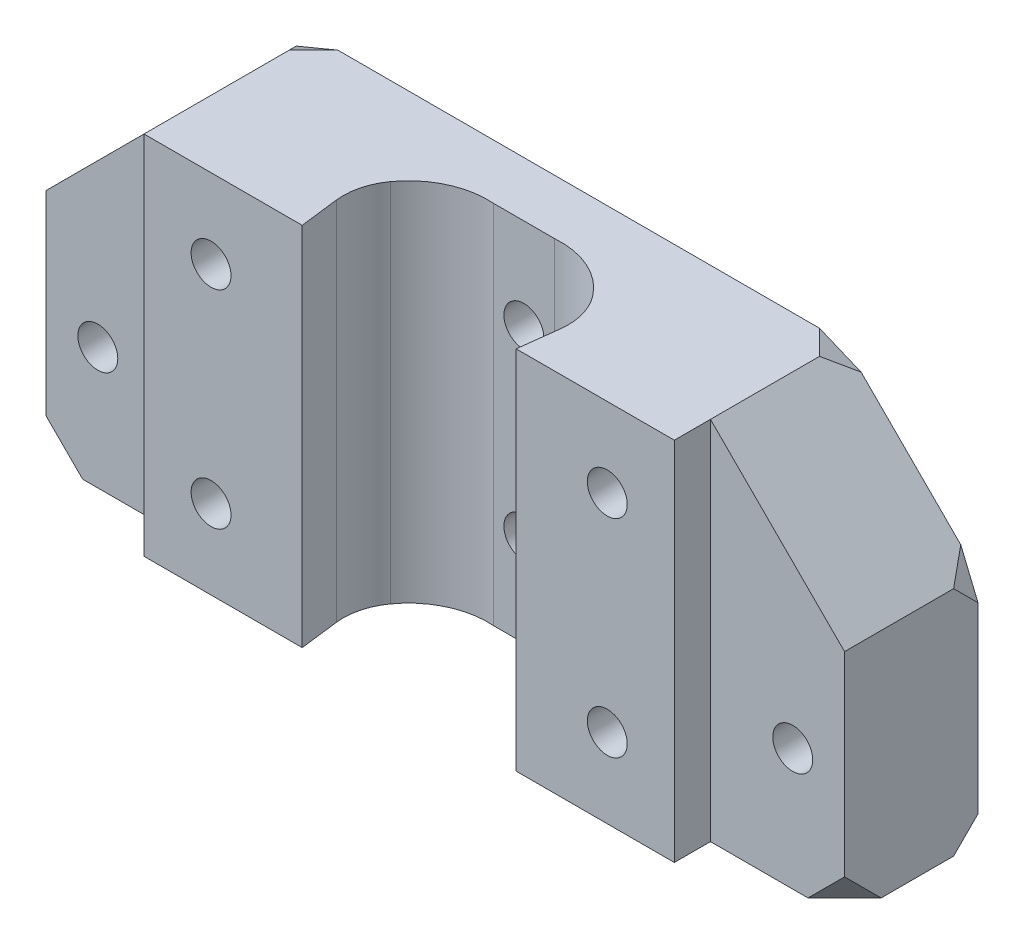
ISO-10303-21;
HEADER;
FILE_DESCRIPTION(('STEP AP214'),'2;1');
FILE_NAME('part.step','',(''),(''),'','','');
FILE_SCHEMA(('AUTOMOTIVE_DESIGN { 1 0 10303 214 1 1 1 1 }'));
ENDSEC;
DATA;
#1=APPLICATION_CONTEXT('core data for automotive mechanical design processes');
#2=APPLICATION_PROTOCOL_DEFINITION('international standard','automotive_design',2000,#1);
#3=PRODUCT_CONTEXT('',#1,'mechanical');
#4=PRODUCT('Part','Part','',(#3));
#5=PRODUCT_RELATED_PRODUCT_CATEGORY('part','',(#4));
#6=PRODUCT_DEFINITION_FORMATION('','',#4);
#7=PRODUCT_DEFINITION_CONTEXT('part definition',#1,'design');
#8=PRODUCT_DEFINITION('design','',#6,#7);
#9=PRODUCT_DEFINITION_SHAPE('','',#8);
#10=(LENGTH_UNIT() NAMED_UNIT(*) SI_UNIT(.MILLI.,.METRE.));
#11=(NAMED_UNIT(*) PLANE_ANGLE_UNIT() SI_UNIT($,.RADIAN.));
#12=(NAMED_UNIT(*) SI_UNIT($,.STERADIAN.) SOLID_ANGLE_UNIT());
#13=UNCERTAINTY_MEASURE_WITH_UNIT(LENGTH_MEASURE(1.E-05),#10,'distance_accuracy_value','');
#14=(GEOMETRIC_REPRESENTATION_CONTEXT(3) GLOBAL_UNCERTAINTY_ASSIGNED_CONTEXT((#13)) GLOBAL_UNIT_ASSIGNED_CONTEXT((#10,
#11,#12)) REPRESENTATION_CONTEXT('',''));
#15=CARTESIAN_POINT('',(0.,0.,0.));
#16=DIRECTION('',(0.,0.,1.));
#17=DIRECTION('',(1.,0.,0.));
#18=AXIS2_PLACEMENT_3D('',#15,#16,#17);
#19=CARTESIAN_POINT('',(12.657693959334,0.,2.96357615590343));
#20=DIRECTION('',(0.,-1.,0.));
#21=DIRECTION('',(0.,0.,-1.));
#22=AXIS2_PLACEMENT_3D('',#19,#20,#21);
#23=PLANE('',#22);
#24=DIRECTION('',(-1.,0.,0.));
#25=VECTOR('',#24,1.);
#26=CARTESIAN_POINT('',(62.1301615680965,0.,-19.));
#27=LINE('',#26,#25);
#28=CARTESIAN_POINT('',(80.1301615680965,0.,-19.));
#29=VERTEX_POINT('',#28);
#30=CARTESIAN_POINT('',(-42.8698384319035,0.,-19.));
#31=VERTEX_POINT('',#30);
#32=EDGE_CURVE('E216',#29,#31,#27,.T.);
#33=ORIENTED_EDGE('',*,*,#32,.F.);
#34=DIRECTION('',(0.707106781186548,0.,0.707106781186547));
#35=VECTOR('',#34,1.);
#36=CARTESIAN_POINT('',(57.3757158416669,0.,-41.7544457264295));
#37=LINE('',#36,#35);
#38=CARTESIAN_POINT('',(84.1301615680965,0.,-15.));
#39=VERTEX_POINT('',#38);
#40=EDGE_CURVE('E49',#29,#39,#37,.T.);
#41=ORIENTED_EDGE('',*,*,#40,.T.);
#42=DIRECTION('',(0.,0.,1.));
#43=VECTOR('',#42,1.);
#44=CARTESIAN_POINT('',(84.1301615680965,0.,-19.));
#45=LINE('',#44,#43);
#46=CARTESIAN_POINT('',(84.1301615680965,0.,-3.11185281572853));
#47=VERTEX_POINT('',#46);
#48=EDGE_CURVE('E204',#39,#47,#45,.T.);
#49=ORIENTED_EDGE('',*,*,#48,.T.);
#50=DIRECTION('',(-0.707106781186548,0.,0.707106781186547));
#51=VECTOR('',#50,1.);
#52=CARTESIAN_POINT('',(45.3562132778992,0.,35.6620954744687));
#53=LINE('',#52,#51);
#54=CARTESIAN_POINT('',(78.1301615680965,0.,2.88814718427147));
#55=VERTEX_POINT('',#54);
#56=EDGE_CURVE('E272',#47,#55,#53,.T.);
#57=ORIENTED_EDGE('',*,*,#56,.T.);
#58=DIRECTION('',(-1.,0.,0.));
#59=VECTOR('',#58,1.);
#60=CARTESIAN_POINT('',(84.1301615680965,0.,2.88814718427147));
#61=LINE('',#60,#59);
#62=CARTESIAN_POINT('',(62.1301615680965,0.,2.88814718427147));
#63=VERTEX_POINT('',#62);
#64=EDGE_CURVE('E211',#55,#63,#61,.T.);
#65=ORIENTED_EDGE('',*,*,#64,.T.);
#66=DIRECTION('',(0.,0.,1.));
#67=VECTOR('',#66,1.);
#68=CARTESIAN_POINT('',(62.1301615680965,0.,-76.9061812346819));
#69=LINE('',#68,#67);
#70=CARTESIAN_POINT('',(62.1301615680965,0.,8.81314718427147));
#71=VERTEX_POINT('',#70);
#72=EDGE_CURVE('E373',#63,#71,#69,.T.);
#73=ORIENTED_EDGE('',*,*,#72,.T.);
#74=DIRECTION('',(-1.,0.,0.));
#75=VECTOR('',#74,1.);
#76=CARTESIAN_POINT('',(-2.86983843190352,0.,8.81314718427147));
#77=LINE('',#76,#75);
#78=CARTESIAN_POINT('',(36.1782047289997,0.,8.81314718427147));
#79=VERTEX_POINT('',#78);
#80=EDGE_CURVE('E352',#71,#79,#77,.T.);
#81=ORIENTED_EDGE('',*,*,#80,.T.);
#82=DIRECTION('',(0.121869343405151,0.,-0.992546151641322));
#83=VECTOR('',#82,1.);
#84=CARTESIAN_POINT('',(33.961097926045,0.,26.8700330553533));
#85=LINE('',#84,#83);
#86=CARTESIAN_POINT('',(36.970576623517,2.22044604925031E-13,2.35979597553153));
#87=VERTEX_POINT('',#86);
#88=EDGE_CURVE('E300',#79,#87,#85,.T.);
#89=ORIENTED_EDGE('',*,*,#88,.T.);
#90=CARTESIAN_POINT('',(27.0451151071038,0.,1.14110254148002));
#91=DIRECTION('',(0.,-1.,0.));
#92=DIRECTION('',(0.,0.,-1.));
#93=AXIS2_PLACEMENT_3D('',#90,#91,#92);
#94=CIRCLE('',#93,10.);
#95=CARTESIAN_POINT('',(34.9994172411373,0.,-4.91934938560512));
#96=VERTEX_POINT('',#95);
#97=EDGE_CURVE('E302',#96,#87,#94,.T.);
#98=ORIENTED_EDGE('',*,*,#97,.F.);
#99=CARTESIAN_POINT('',(24.6588244668938,0.,2.95923811960556));
#100=DIRECTION('',(0.,-1.,0.));
#101=DIRECTION('',(0.,0.,-1.));
#102=AXIS2_PLACEMENT_3D('',#99,#100,#101);
#103=CIRCLE('',#102,13.);
#104=CARTESIAN_POINT('',(23.6301615680965,0.,-10.));
#105=VERTEX_POINT('',#104);
#106=EDGE_CURVE('E306',#105,#96,#103,.T.);
#107=ORIENTED_EDGE('',*,*,#106,.F.);
#108=DIRECTION('',(1.,0.,0.));
#109=VECTOR('',#108,1.);
#110=CARTESIAN_POINT('',(12.657693959334,0.,-10.));
#111=LINE('',#110,#109);
#112=CARTESIAN_POINT('',(13.6301615680965,0.,-10.));
#113=VERTEX_POINT('',#112);
#114=EDGE_CURVE('E303',#105,#113,#111,.F.);
#115=ORIENTED_EDGE('',*,*,#114,.T.);
#116=CARTESIAN_POINT('',(12.657693959334,0.,2.96357615590343));
#117=DIRECTION('',(0.,-1.,0.));
#118=DIRECTION('',(0.,0.,-1.));
#119=AXIS2_PLACEMENT_3D('',#116,#117,#118);
#120=CIRCLE('',#119,13.);
#121=CARTESIAN_POINT('',(2.1101832656479,0.,-4.63576711615484));
#122=VERTEX_POINT('',#121);
#123=EDGE_CURVE('E312',#122,#113,#120,.T.);
#124=ORIENTED_EDGE('',*,*,#123,.F.);
#125=CARTESIAN_POINT('',(10.2236530300218,0.,1.20988155465921));
#126=DIRECTION('',(0.,-1.,0.));
#127=DIRECTION('',(0.,0.,-1.));
#128=AXIS2_PLACEMENT_3D('',#125,#126,#127);
#129=CIRCLE('',#128,10.);
#130=CARTESIAN_POINT('',(0.298191513608604,0.,2.42857498871066));
#131=VERTEX_POINT('',#130);
#132=EDGE_CURVE('E310',#131,#122,#129,.T.);
#133=ORIENTED_EDGE('',*,*,#132,.F.);
#134=DIRECTION('',(0.121869343405145,0.,0.992546151641322));
#135=VECTOR('',#134,1.);
#136=CARTESIAN_POINT('',(0.298191513608603,0.,2.42857498871065));
#137=LINE('',#136,#135);
#138=CARTESIAN_POINT('',(1.08211840719341,0.,8.81314718427147));
#139=VERTEX_POINT('',#138);
#140=EDGE_CURVE('E297',#131,#139,#137,.T.);
#141=ORIENTED_EDGE('',*,*,#140,.T.);
#142=CARTESIAN_POINT('',(-24.8698384319035,0.,8.81314718427147));
#143=VERTEX_POINT('',#142);
#144=EDGE_CURVE('E355',#139,#143,#77,.T.);
#145=ORIENTED_EDGE('',*,*,#144,.T.);
#146=DIRECTION('',(0.,0.,1.));
#147=VECTOR('',#146,1.);
#148=CARTESIAN_POINT('',(-24.8698384319035,0.,-76.9061812346819));
#149=LINE('',#148,#147);
#150=CARTESIAN_POINT('',(-24.8698384319035,0.,2.88814718427147));
#151=VERTEX_POINT('',#150);
#152=EDGE_CURVE('E361',#151,#143,#149,.T.);
#153=ORIENTED_EDGE('',*,*,#152,.F.);
#154=DIRECTION('',(1.,0.,0.));
#155=VECTOR('',#154,1.);
#156=CARTESIAN_POINT('',(-46.8698384319035,0.,2.88814718427147));
#157=LINE('',#156,#155);
#158=CARTESIAN_POINT('',(-40.8698384319035,0.,2.88814718427147));
#159=VERTEX_POINT('',#158);
#160=EDGE_CURVE('E411',#159,#151,#157,.T.);
#161=ORIENTED_EDGE('',*,*,#160,.F.);
#162=DIRECTION('',(-0.707106781186547,0.,-0.707106781186548));
#163=VECTOR('',#162,1.);
#164=CARTESIAN_POINT('',(-14.0683577504688,0.,29.6896278657062));
#165=LINE('',#164,#163);
#166=CARTESIAN_POINT('',(-46.8698384319035,0.,-3.11185281572854));
#167=VERTEX_POINT('',#166);
#168=EDGE_CURVE('E265',#159,#167,#165,.T.);
#169=ORIENTED_EDGE('',*,*,#168,.T.);
#170=DIRECTION('',(0.,0.,1.));
#171=VECTOR('',#170,1.);
#172=CARTESIAN_POINT('',(-46.8698384319035,0.,-19.));
#173=LINE('',#172,#171);
#174=CARTESIAN_POINT('',(-46.8698384319035,0.,-15.));
#175=VERTEX_POINT('',#174);
#176=EDGE_CURVE('E422',#175,#167,#173,.T.);
#177=ORIENTED_EDGE('',*,*,#176,.F.);
#178=DIRECTION('',(0.707106781186547,0.,-0.707106781186548));
#179=VECTOR('',#178,1.);
#180=CARTESIAN_POINT('',(-26.0878603142365,0.,-35.781978117667));
#181=LINE('',#180,#179);
#182=EDGE_CURVE('E257',#175,#31,#181,.T.);
#183=ORIENTED_EDGE('',*,*,#182,.T.);
#184=EDGE_LOOP('',(#33,#41,#49,#57,#65,#73,#81,#89,#98,#107,#115,#124,#133,#141,#145,#153,#161,
#169,#177,#183));
#185=FACE_BOUND('',#184,.T.);
#186=ADVANCED_FACE('F40',(#185),#23,.T.);
#187=CARTESIAN_POINT('',(62.1301615680966,60.,0.));
#188=DIRECTION('',(-0.707106781186549,-0.707106781186546,0.));
#189=DIRECTION('',(0.,0.,-1.));
#190=AXIS2_PLACEMENT_3D('',#187,#188,#189);
#191=PLANE('',#190);
#192=DIRECTION('',(0.,0.,1.));
#193=VECTOR('',#192,1.);
#194=CARTESIAN_POINT('',(84.1301615680965,38.,0.));
#195=LINE('',#194,#193);
#196=CARTESIAN_POINT('',(84.1301615680965,38.,-14.9999999999999));
#197=VERTEX_POINT('',#196);
#198=CARTESIAN_POINT('',(84.1301615680965,38.,2.88814718427147));
#199=VERTEX_POINT('',#198);
#200=EDGE_CURVE('E282',#197,#199,#195,.T.);
#201=ORIENTED_EDGE('',*,*,#200,.F.);
#202=DIRECTION('',(0.499999999999998,-0.499999999999999,0.70710678118655));
#203=VECTOR('',#202,1.);
#204=CARTESIAN_POINT('',(78.4334624269956,43.6966991411009,-23.0563491861039));
#205=LINE('',#204,#203);
#206=CARTESIAN_POINT('',(81.3017344433502,40.8284271247463,-19.));
#207=VERTEX_POINT('',#206);
#208=EDGE_CURVE('E227',#197,#207,#205,.F.);
#209=ORIENTED_EDGE('',*,*,#208,.T.);
#210=DIRECTION('',(-0.707106781186546,0.707106781186549,0.));
#211=VECTOR('',#210,1.);
#212=CARTESIAN_POINT('',(62.1301615680966,60.,-19.));
#213=LINE('',#212,#211);
#214=CARTESIAN_POINT('',(64.9585886928426,57.1715728752539,-19.));
#215=VERTEX_POINT('',#214);
#216=EDGE_CURVE('E284',#215,#207,#213,.F.);
#217=ORIENTED_EDGE('',*,*,#216,.F.);
#218=DIRECTION('',(0.499999999999998,-0.5,-0.707106781186549));
#219=VECTOR('',#218,1.);
#220=CARTESIAN_POINT('',(56.8268607091974,65.3033008588991,-7.50000000000003));
#221=LINE('',#220,#219);
#222=CARTESIAN_POINT('',(62.1301615680966,60.,-15.0000000000001));
#223=VERTEX_POINT('',#222);
#224=EDGE_CURVE('E229',#215,#223,#221,.F.);
#225=ORIENTED_EDGE('',*,*,#224,.T.);
#226=DIRECTION('',(0.,0.,-1.));
#227=VECTOR('',#226,1.);
#228=CARTESIAN_POINT('',(62.1301615680966,60.,0.));
#229=LINE('',#228,#227);
#230=CARTESIAN_POINT('',(62.1301615680965,60.,2.88814718427147));
#231=VERTEX_POINT('',#230);
#232=EDGE_CURVE('E290',#231,#223,#229,.T.);
#233=ORIENTED_EDGE('',*,*,#232,.F.);
#234=DIRECTION('',(0.707106781186546,-0.707106781186549,0.));
#235=VECTOR('',#234,1.);
#236=CARTESIAN_POINT('',(103.130161568096,18.9999999999999,2.88814718427147));
#237=LINE('',#236,#235);
#238=EDGE_CURVE('E280',#199,#231,#237,.F.);
#239=ORIENTED_EDGE('',*,*,#238,.F.);
#240=EDGE_LOOP('',(#201,#209,#217,#225,#233,#239));
#241=FACE_BOUND('',#240,.T.);
#242=ADVANCED_FACE('F486',(#241),#191,.F.);
#243=CARTESIAN_POINT('',(-46.8698384319035,38.,0.));
#244=DIRECTION('',(0.707106781186547,-0.707106781186549,0.));
#245=DIRECTION('',(0.,0.,-1.));
#246=AXIS2_PLACEMENT_3D('',#243,#244,#245);
#247=PLANE('',#246);
#248=DIRECTION('',(0.,0.,1.));
#249=VECTOR('',#248,1.);
#250=CARTESIAN_POINT('',(-24.8698384319035,60.,0.));
#251=LINE('',#250,#249);
#252=CARTESIAN_POINT('',(-24.8698384319035,60.,-15.));
#253=VERTEX_POINT('',#252);
#254=CARTESIAN_POINT('',(-24.8698384319035,60.,2.88814718427147));
#255=VERTEX_POINT('',#254);
#256=EDGE_CURVE('E293',#253,#255,#251,.T.);
#257=ORIENTED_EDGE('',*,*,#256,.F.);
#258=DIRECTION('',(0.5,0.499999999999999,0.707106781186548));
#259=VECTOR('',#258,1.);
#260=CARTESIAN_POINT('',(-30.5665375730044,54.3033008588991,-23.056349186104));
#261=LINE('',#260,#259);
#262=CARTESIAN_POINT('',(-27.6982655566497,57.1715728752538,-19.));
#263=VERTEX_POINT('',#262);
#264=EDGE_CURVE('E236',#253,#263,#261,.F.);
#265=ORIENTED_EDGE('',*,*,#264,.T.);
#266=DIRECTION('',(-0.707106781186549,-0.707106781186547,0.));
#267=VECTOR('',#266,1.);
#268=CARTESIAN_POINT('',(-46.8698384319035,38.,-19.));
#269=LINE('',#268,#267);
#270=CARTESIAN_POINT('',(-44.0414113071574,40.8284271247462,-19.));
#271=VERTEX_POINT('',#270);
#272=EDGE_CURVE('E287',#271,#263,#269,.F.);
#273=ORIENTED_EDGE('',*,*,#272,.F.);
#274=DIRECTION('',(-0.5,-0.499999999999998,0.707106781186549));
#275=VECTOR('',#274,1.);
#276=CARTESIAN_POINT('',(-52.1731392908026,32.6966991411009,-7.49999999999998));
#277=LINE('',#276,#275);
#278=CARTESIAN_POINT('',(-46.8698384319035,38.,-15.));
#279=VERTEX_POINT('',#278);
#280=EDGE_CURVE('E243',#279,#271,#277,.F.);
#281=ORIENTED_EDGE('',*,*,#280,.F.);
#282=DIRECTION('',(0.,0.,-1.));
#283=VECTOR('',#282,1.);
#284=CARTESIAN_POINT('',(-46.8698384319035,38.,0.));
#285=LINE('',#284,#283);
#286=CARTESIAN_POINT('',(-46.8698384319035,38.,2.88814718427147));
#287=VERTEX_POINT('',#286);
#288=EDGE_CURVE('E277',#287,#279,#285,.T.);
#289=ORIENTED_EDGE('',*,*,#288,.F.);
#290=DIRECTION('',(0.707106781186549,0.707106781186547,0.));
#291=VECTOR('',#290,1.);
#292=CARTESIAN_POINT('',(-46.8698384319035,38.,2.88814718427147));
#293=LINE('',#292,#291);
#294=EDGE_CURVE('E274',#255,#287,#293,.F.);
#295=ORIENTED_EDGE('',*,*,#294,.F.);
#296=EDGE_LOOP('',(#257,#265,#273,#281,#289,#295));
#297=FACE_BOUND('',#296,.T.);
#298=ADVANCED_FACE('F43',(#297),#247,.F.);
#299=CARTESIAN_POINT('',(-46.8698384319035,0.,0.));
#300=DIRECTION('',(1.,0.,0.));
#301=DIRECTION('',(0.,0.,-1.));
#302=AXIS2_PLACEMENT_3D('',#299,#300,#301);
#303=PLANE('',#302);
#304=ORIENTED_EDGE('',*,*,#288,.T.);
#305=DIRECTION('',(0.,-0.707106781186548,-0.707106781186547));
#306=VECTOR('',#305,1.);
#307=CARTESIAN_POINT('',(-46.8698384319035,26.5,-26.5));
#308=LINE('',#307,#306);
#309=CARTESIAN_POINT('',(-46.8698384319035,34.,-19.));
#310=VERTEX_POINT('',#309);
#311=EDGE_CURVE('E246',#279,#310,#308,.T.);
#312=ORIENTED_EDGE('',*,*,#311,.T.);
#313=DIRECTION('',(0.,-1.,0.));
#314=VECTOR('',#313,1.);
#315=CARTESIAN_POINT('',(-46.8698384319035,0.,-19.));
#316=LINE('',#315,#314);
#317=CARTESIAN_POINT('',(-46.8698384319035,4.,-19.));
#318=VERTEX_POINT('',#317);
#319=EDGE_CURVE('E419',#310,#318,#316,.T.);
#320=ORIENTED_EDGE('',*,*,#319,.T.);
#321=DIRECTION('',(0.,0.707106781186548,-0.707106781186547));
#322=VECTOR('',#321,1.);
#323=CARTESIAN_POINT('',(-46.8698384319035,-7.5,-7.5));
#324=LINE('',#323,#322);
#325=EDGE_CURVE('E251',#175,#318,#324,.T.);
#326=ORIENTED_EDGE('',*,*,#325,.F.);
#327=ORIENTED_EDGE('',*,*,#176,.T.);
#328=DIRECTION('',(0.,-0.707106781186547,-0.707106781186548));
#329=VECTOR('',#328,1.);
#330=CARTESIAN_POINT('',(-46.8698384319035,1.55592640786427,-1.55592640786427));
#331=LINE('',#330,#329);
#332=CARTESIAN_POINT('',(-46.8698384319035,6.00000000000001,2.88814718427147));
#333=VERTEX_POINT('',#332);
#334=EDGE_CURVE('E259',#333,#167,#331,.T.);
#335=ORIENTED_EDGE('',*,*,#334,.F.);
#336=DIRECTION('',(0.,1.,0.));
#337=VECTOR('',#336,1.);
#338=CARTESIAN_POINT('',(-46.8698384319035,0.,2.88814718427147));
#339=LINE('',#338,#337);
#340=EDGE_CURVE('E415',#333,#287,#339,.T.);
#341=ORIENTED_EDGE('',*,*,#340,.T.);
#342=EDGE_LOOP('',(#304,#312,#320,#326,#327,#335,#341));
#343=FACE_BOUND('',#342,.T.);
#344=ADVANCED_FACE('F452',(#343),#303,.F.);
#345=CARTESIAN_POINT('',(0.,0.,-19.));
#346=DIRECTION('',(0.,0.,1.));
#347=DIRECTION('',(1.,0.,0.));
#348=AXIS2_PLACEMENT_3D('',#345,#346,#347);
#349=PLANE('',#348);
#350=DIRECTION('',(0.707106781186548,0.707106781186547,0.));
#351=VECTOR('',#350,1.);
#352=CARTESIAN_POINT('',(40.0650807840482,-40.0650807840483,-19.));
#353=LINE('',#352,#351);
#354=CARTESIAN_POINT('',(84.1301615680965,3.99999999999999,-19.));
#355=VERTEX_POINT('',#354);
#356=EDGE_CURVE('E56',#29,#355,#353,.T.);
#357=ORIENTED_EDGE('',*,*,#356,.F.);
#358=ORIENTED_EDGE('',*,*,#32,.T.);
#359=DIRECTION('',(0.707106781186547,-0.707106781186548,0.));
#360=VECTOR('',#359,1.);
#361=CARTESIAN_POINT('',(-21.4349192159518,-21.4349192159518,-19.));
#362=LINE('',#361,#360);
#363=EDGE_CURVE('E254',#318,#31,#362,.T.);
#364=ORIENTED_EDGE('',*,*,#363,.F.);
#365=ORIENTED_EDGE('',*,*,#319,.F.);
#366=DIRECTION('',(0.38268343236509,0.923879532511287,0.));
#367=VECTOR('',#366,1.);
#368=CARTESIAN_POINT('',(-52.0267247902815,21.5501750139871,-19.));
#369=LINE('',#368,#367);
#370=EDGE_CURVE('E248',#310,#271,#369,.T.);
#371=ORIENTED_EDGE('',*,*,#370,.T.);
#372=ORIENTED_EDGE('',*,*,#272,.T.);
#373=DIRECTION('',(-0.923879532511287,-0.382683432365089,0.));
#374=VECTOR('',#373,1.);
#375=CARTESIAN_POINT('',(-24.2695205128148,58.5918055743297,-19.));
#376=LINE('',#375,#374);
#377=CARTESIAN_POINT('',(-20.8698384319034,60.,-19.));
#378=VERTEX_POINT('',#377);
#379=EDGE_CURVE('E241',#378,#263,#376,.T.);
#380=ORIENTED_EDGE('',*,*,#379,.F.);
#381=DIRECTION('',(1.,0.,0.));
#382=VECTOR('',#381,1.);
#383=CARTESIAN_POINT('',(62.1301615680965,60.,-19.));
#384=LINE('',#383,#382);
#385=CARTESIAN_POINT('',(58.1301615680967,60.,-19.));
#386=VERTEX_POINT('',#385);
#387=EDGE_CURVE('E385',#378,#386,#384,.T.);
#388=ORIENTED_EDGE('',*,*,#387,.T.);
#389=DIRECTION('',(-0.923879532511287,0.38268343236509,0.));
#390=VECTOR('',#389,1.);
#391=CARTESIAN_POINT('',(29.7261685015094,71.7653191537318,-19.));
#392=LINE('',#391,#390);
#393=EDGE_CURVE('E234',#215,#386,#392,.T.);
#394=ORIENTED_EDGE('',*,*,#393,.F.);
#395=ORIENTED_EDGE('',*,*,#216,.T.);
#396=DIRECTION('',(-0.382683432365088,0.923879532511288,0.));
#397=VECTOR('',#396,1.);
#398=CARTESIAN_POINT('',(83.83039993778,34.723688593389,-19.));
#399=LINE('',#398,#397);
#400=CARTESIAN_POINT('',(84.1301615680965,33.9999999999999,-19.));
#401=VERTEX_POINT('',#400);
#402=EDGE_CURVE('E222',#401,#207,#399,.T.);
#403=ORIENTED_EDGE('',*,*,#402,.F.);
#404=DIRECTION('',(0.,-1.,0.));
#405=VECTOR('',#404,1.);
#406=CARTESIAN_POINT('',(84.1301615680965,0.,-19.));
#407=LINE('',#406,#405);
#408=EDGE_CURVE('E433',#401,#355,#407,.T.);
#409=ORIENTED_EDGE('',*,*,#408,.T.);
#410=EDGE_LOOP('',(#357,#358,#364,#365,#371,#372,#380,#388,#394,#395,#403,#409));
#411=FACE_BOUND('',#410,.T.);
#412=CARTESIAN_POINT('',(75.6301615680965,20.,-19.));
#413=DIRECTION('',(0.,0.,-1.));
#414=DIRECTION('',(-1.,0.,0.));
#415=AXIS2_PLACEMENT_3D('',#412,#413,#414);
#416=CIRCLE('',#415,3.275);
#417=CARTESIAN_POINT('',(72.3551615680965,20.,-19.));
#418=VERTEX_POINT('',#417);
#419=EDGE_CURVE('E434',#418,#418,#416,.T.);
#420=ORIENTED_EDGE('',*,*,#419,.F.);
#421=EDGE_LOOP('',(#420));
#422=FACE_BOUND('',#421,.T.);
#423=CARTESIAN_POINT('',(-38.3698384319035,20.,-19.));
#424=DIRECTION('',(0.,0.,1.));
#425=DIRECTION('',(1.,0.,0.));
#426=AXIS2_PLACEMENT_3D('',#423,#424,#425);
#427=CIRCLE('',#426,3.275);
#428=CARTESIAN_POINT('',(-35.0948384319035,20.,-19.));
#429=VERTEX_POINT('',#428);
#430=EDGE_CURVE('E420',#429,#429,#427,.T.);
#431=ORIENTED_EDGE('',*,*,#430,.T.);
#432=EDGE_LOOP('',(#431));
#433=FACE_BOUND('',#432,.T.);
#434=CARTESIAN_POINT('',(18.6301615680965,15.,-19.));
#435=DIRECTION('',(0.,0.,-1.));
#436=DIRECTION('',(-1.,0.,0.));
#437=AXIS2_PLACEMENT_3D('',#434,#435,#436);
#438=CIRCLE('',#437,3.275);
#439=CARTESIAN_POINT('',(15.3551615680965,15.,-19.));
#440=VERTEX_POINT('',#439);
#441=EDGE_CURVE('E407',#440,#440,#438,.T.);
#442=ORIENTED_EDGE('',*,*,#441,.F.);
#443=EDGE_LOOP('',(#442));
#444=FACE_BOUND('',#443,.T.);
#445=CARTESIAN_POINT('',(18.6301615680965,45.,-19.));
#446=DIRECTION('',(0.,0.,-1.));
#447=DIRECTION('',(-1.,0.,0.));
#448=AXIS2_PLACEMENT_3D('',#445,#446,#447);
#449=CIRCLE('',#448,3.275);
#450=CARTESIAN_POINT('',(15.3551615680965,45.,-19.));
#451=VERTEX_POINT('',#450);
#452=EDGE_CURVE('E408',#451,#451,#449,.T.);
#453=ORIENTED_EDGE('',*,*,#452,.F.);
#454=EDGE_LOOP('',(#453));
#455=FACE_BOUND('',#454,.T.);
#456=CARTESIAN_POINT('',(51.1301615680965,47.,-19.));
#457=DIRECTION('',(0.,0.,-1.));
#458=DIRECTION('',(-1.,0.,0.));
#459=AXIS2_PLACEMENT_3D('',#456,#457,#458);
#460=CIRCLE('',#459,3.275);
#461=CARTESIAN_POINT('',(47.8551615680965,47.,-19.));
#462=VERTEX_POINT('',#461);
#463=EDGE_CURVE('E389',#462,#462,#460,.T.);
#464=ORIENTED_EDGE('',*,*,#463,.F.);
#465=EDGE_LOOP('',(#464));
#466=FACE_BOUND('',#465,.T.);
#467=CARTESIAN_POINT('',(51.1301615680965,13.,-19.));
#468=DIRECTION('',(0.,0.,-1.));
#469=DIRECTION('',(-1.,0.,0.));
#470=AXIS2_PLACEMENT_3D('',#467,#468,#469);
#471=CIRCLE('',#470,3.275);
#472=CARTESIAN_POINT('',(47.8551615680965,13.,-19.));
#473=VERTEX_POINT('',#472);
#474=EDGE_CURVE('E392',#473,#473,#471,.T.);
#475=ORIENTED_EDGE('',*,*,#474,.F.);
#476=EDGE_LOOP('',(#475));
#477=FACE_BOUND('',#476,.T.);
#478=CARTESIAN_POINT('',(-13.8698384319035,13.,-19.));
#479=DIRECTION('',(0.,0.,-1.));
#480=DIRECTION('',(-1.,0.,0.));
#481=AXIS2_PLACEMENT_3D('',#478,#479,#480);
#482=CIRCLE('',#481,3.275);
#483=CARTESIAN_POINT('',(-17.1448384319035,13.,-19.));
#484=VERTEX_POINT('',#483);
#485=EDGE_CURVE('E395',#484,#484,#482,.T.);
#486=ORIENTED_EDGE('',*,*,#485,.F.);
#487=EDGE_LOOP('',(#486));
#488=FACE_BOUND('',#487,.T.);
#489=CARTESIAN_POINT('',(-13.8698384319035,47.,-19.));
#490=DIRECTION('',(0.,0.,-1.));
#491=DIRECTION('',(-1.,0.,0.));
#492=AXIS2_PLACEMENT_3D('',#489,#490,#491);
#493=CIRCLE('',#492,3.275);
#494=CARTESIAN_POINT('',(-17.1448384319035,47.,-19.));
#495=VERTEX_POINT('',#494);
#496=EDGE_CURVE('E398',#495,#495,#493,.T.);
#497=ORIENTED_EDGE('',*,*,#496,.F.);
#498=EDGE_LOOP('',(#497));
#499=FACE_BOUND('',#498,.T.);
#500=ADVANCED_FACE('F448',(#411,#422,#433,#444,#455,#466,#477,#488,#499),#349,.F.);
#501=CARTESIAN_POINT('',(84.1301615680965,0.,2.88814718427147));
#502=DIRECTION('',(0.,0.,1.));
#503=DIRECTION('',(1.,0.,0.));
#504=AXIS2_PLACEMENT_3D('',#501,#502,#503);
#505=PLANE('',#504);
#506=CARTESIAN_POINT('',(75.6301615680965,20.,2.88814718427147));
#507=DIRECTION('',(0.,0.,-1.));
#508=DIRECTION('',(-1.,0.,0.));
#509=AXIS2_PLACEMENT_3D('',#506,#507,#508);
#510=CIRCLE('',#509,3.275);
#511=CARTESIAN_POINT('',(72.3551615680965,20.,2.88814718427147));
#512=VERTEX_POINT('',#511);
#513=EDGE_CURVE('E439',#512,#512,#510,.T.);
#514=ORIENTED_EDGE('',*,*,#513,.T.);
#515=EDGE_LOOP('',(#514));
#516=FACE_BOUND('',#515,.T.);
#517=ORIENTED_EDGE('',*,*,#64,.F.);
#518=DIRECTION('',(0.707106781186548,0.707106781186547,0.));
#519=VECTOR('',#518,1.);
#520=CARTESIAN_POINT('',(81.1301615680965,3.00000000000002,2.88814718427147));
#521=LINE('',#520,#519);
#522=CARTESIAN_POINT('',(84.1301615680965,6.00000000000002,2.88814718427147));
#523=VERTEX_POINT('',#522);
#524=EDGE_CURVE('E269',#55,#523,#521,.T.);
#525=ORIENTED_EDGE('',*,*,#524,.T.);
#526=DIRECTION('',(0.,1.,0.));
#527=VECTOR('',#526,1.);
#528=CARTESIAN_POINT('',(84.1301615680965,0.,2.88814718427147));
#529=LINE('',#528,#527);
#530=EDGE_CURVE('E212',#523,#199,#529,.T.);
#531=ORIENTED_EDGE('',*,*,#530,.T.);
#532=ORIENTED_EDGE('',*,*,#238,.T.);
#533=DIRECTION('',(0.,1.,0.));
#534=VECTOR('',#533,1.);
#535=CARTESIAN_POINT('',(62.1301615680965,0.,2.88814718427147));
#536=LINE('',#535,#534);
#537=EDGE_CURVE('E431',#63,#231,#536,.T.);
#538=ORIENTED_EDGE('',*,*,#537,.F.);
#539=EDGE_LOOP('',(#517,#525,#531,#532,#538));
#540=FACE_BOUND('',#539,.T.);
#541=ADVANCED_FACE('F451',(#516,#540),#505,.T.);
#542=CARTESIAN_POINT('',(62.1301615680965,0.,-76.9061812346819));
#543=DIRECTION('',(1.,0.,0.));
#544=DIRECTION('',(0.,1.,0.));
#545=AXIS2_PLACEMENT_3D('',#542,#543,#544);
#546=PLANE('',#545);
#547=ORIENTED_EDGE('',*,*,#72,.F.);
#548=ORIENTED_EDGE('',*,*,#537,.T.);
#549=DIRECTION('',(0.,0.,1.));
#550=VECTOR('',#549,1.);
#551=CARTESIAN_POINT('',(62.1301615680965,60.,-76.9061812346819));
#552=LINE('',#551,#550);
#553=CARTESIAN_POINT('',(62.1301615680965,60.,8.81314718427147));
#554=VERTEX_POINT('',#553);
#555=EDGE_CURVE('E372',#231,#554,#552,.T.);
#556=ORIENTED_EDGE('',*,*,#555,.T.);
#557=DIRECTION('',(0.,1.,0.));
#558=VECTOR('',#557,1.);
#559=CARTESIAN_POINT('',(62.1301615680965,0.,8.81314718427147));
#560=LINE('',#559,#558);
#561=EDGE_CURVE('E375',#71,#554,#560,.T.);
#562=ORIENTED_EDGE('',*,*,#561,.F.);
#563=EDGE_LOOP('',(#547,#548,#556,#562));
#564=FACE_BOUND('',#563,.T.);
#565=ADVANCED_FACE('F502',(#564),#546,.T.);
#566=CARTESIAN_POINT('',(0.,60.,0.));
#567=DIRECTION('',(0.,-1.,0.));
#568=DIRECTION('',(0.,0.,-1.));
#569=AXIS2_PLACEMENT_3D('',#566,#567,#568);
#570=PLANE('',#569);
#571=DIRECTION('',(0.707106781186547,0.,0.707106781186548));
#572=VECTOR('',#571,1.);
#573=CARTESIAN_POINT('',(38.5650807840484,60.,-38.5650807840483));
#574=LINE('',#573,#572);
#575=EDGE_CURVE('E232',#386,#223,#574,.T.);
#576=ORIENTED_EDGE('',*,*,#575,.F.);
#577=ORIENTED_EDGE('',*,*,#387,.F.);
#578=DIRECTION('',(0.707106781186547,0.,-0.707106781186548));
#579=VECTOR('',#578,1.);
#580=CARTESIAN_POINT('',(-19.9349192159517,60.,-19.9349192159517));
#581=LINE('',#580,#579);
#582=EDGE_CURVE('E239',#253,#378,#581,.T.);
#583=ORIENTED_EDGE('',*,*,#582,.F.);
#584=ORIENTED_EDGE('',*,*,#256,.T.);
#585=DIRECTION('',(0.,0.,1.));
#586=VECTOR('',#585,1.);
#587=CARTESIAN_POINT('',(-24.8698384319035,60.,-76.9061812346819));
#588=LINE('',#587,#586);
#589=CARTESIAN_POINT('',(-24.8698384319035,60.,8.81314718427147));
#590=VERTEX_POINT('',#589);
#591=EDGE_CURVE('E359',#255,#590,#588,.T.);
#592=ORIENTED_EDGE('',*,*,#591,.T.);
#593=DIRECTION('',(-1.,0.,0.));
#594=VECTOR('',#593,1.);
#595=CARTESIAN_POINT('',(-2.86983843190352,60.,8.81314718427147));
#596=LINE('',#595,#594);
#597=CARTESIAN_POINT('',(1.08211840719341,60.,8.81314718427147));
#598=VERTEX_POINT('',#597);
#599=EDGE_CURVE('E356',#598,#590,#596,.T.);
#600=ORIENTED_EDGE('',*,*,#599,.F.);
#601=DIRECTION('',(-0.121869343405144,0.,-0.992546151641323));
#602=VECTOR('',#601,1.);
#603=CARTESIAN_POINT('',(0.298191513608607,60.0000000000001,2.42857498871066));
#604=LINE('',#603,#602);
#605=CARTESIAN_POINT('',(0.298191513608606,60.0000000000002,2.42857498871065));
#606=VERTEX_POINT('',#605);
#607=EDGE_CURVE('E324',#598,#606,#604,.T.);
#608=ORIENTED_EDGE('',*,*,#607,.T.);
#609=CARTESIAN_POINT('',(10.2236530300218,60.0000000000001,1.20988155465921));
#610=DIRECTION('',(0.,-1.,0.));
#611=DIRECTION('',(0.,0.,-1.));
#612=AXIS2_PLACEMENT_3D('',#609,#610,#611);
#613=CIRCLE('',#612,10.);
#614=CARTESIAN_POINT('',(2.1101832656479,60.,-4.63576711615484));
#615=VERTEX_POINT('',#614);
#616=EDGE_CURVE('E321',#606,#615,#613,.T.);
#617=ORIENTED_EDGE('',*,*,#616,.T.);
#618=CARTESIAN_POINT('',(12.657693959334,60.0000000000001,2.96357615590343));
#619=DIRECTION('',(0.,-1.,0.));
#620=DIRECTION('',(0.,0.,-1.));
#621=AXIS2_PLACEMENT_3D('',#618,#619,#620);
#622=CIRCLE('',#621,13.);
#623=CARTESIAN_POINT('',(13.6301615680965,60.,-10.));
#624=VERTEX_POINT('',#623);
#625=EDGE_CURVE('E318',#615,#624,#622,.T.);
#626=ORIENTED_EDGE('',*,*,#625,.T.);
#627=DIRECTION('',(1.,0.,0.));
#628=VECTOR('',#627,1.);
#629=CARTESIAN_POINT('',(13.6301615680965,60.0000000000001,-10.));
#630=LINE('',#629,#628);
#631=CARTESIAN_POINT('',(23.6301615680965,60.0000000000001,-10.));
#632=VERTEX_POINT('',#631);
#633=EDGE_CURVE('E307',#624,#632,#630,.T.);
#634=ORIENTED_EDGE('',*,*,#633,.T.);
#635=CARTESIAN_POINT('',(24.6588244668938,60.0000000000001,2.95923811960556));
#636=DIRECTION('',(0.,-1.,0.));
#637=DIRECTION('',(0.,0.,-1.));
#638=AXIS2_PLACEMENT_3D('',#635,#636,#637);
#639=CIRCLE('',#638,13.);
#640=CARTESIAN_POINT('',(34.9994172411373,60.,-4.91934938560512));
#641=VERTEX_POINT('',#640);
#642=EDGE_CURVE('E332',#632,#641,#639,.T.);
#643=ORIENTED_EDGE('',*,*,#642,.T.);
#644=CARTESIAN_POINT('',(27.0451151071038,60.0000000000001,1.14110254148002));
#645=DIRECTION('',(0.,-1.,0.));
#646=DIRECTION('',(0.,0.,-1.));
#647=AXIS2_PLACEMENT_3D('',#644,#645,#646);
#648=CIRCLE('',#647,10.);
#649=CARTESIAN_POINT('',(36.970576623517,60.0000000000002,2.35979597553153));
#650=VERTEX_POINT('',#649);
#651=EDGE_CURVE('E329',#641,#650,#648,.T.);
#652=ORIENTED_EDGE('',*,*,#651,.T.);
#653=DIRECTION('',(-0.121869343405151,0.,0.992546151641322));
#654=VECTOR('',#653,1.);
#655=CARTESIAN_POINT('',(36.970576623517,60.0000000000001,2.35979597553153));
#656=LINE('',#655,#654);
#657=CARTESIAN_POINT('',(36.1782047289997,60.0000000000001,8.81314718427147));
#658=VERTEX_POINT('',#657);
#659=EDGE_CURVE('E326',#650,#658,#656,.T.);
#660=ORIENTED_EDGE('',*,*,#659,.T.);
#661=EDGE_CURVE('E353',#554,#658,#596,.T.);
#662=ORIENTED_EDGE('',*,*,#661,.F.);
#663=ORIENTED_EDGE('',*,*,#555,.F.);
#664=ORIENTED_EDGE('',*,*,#232,.T.);
#665=EDGE_LOOP('',(#576,#577,#583,#584,#592,#600,#608,#617,#626,#634,#643,#652,#660,#662,#663,#664));
#666=FACE_BOUND('',#665,.T.);
#667=ADVANCED_FACE('F493',(#666),#570,.F.);
#668=CARTESIAN_POINT('',(12.657693959334,-1.2E-05,2.96357615590343));
#669=DIRECTION('',(0.,1.,0.));
#670=DIRECTION('',(0.,0.,1.));
#671=AXIS2_PLACEMENT_3D('',#668,#669,#670);
#672=CYLINDRICAL_SURFACE('',#671,13.);
#673=DIRECTION('',(0.,1.,0.));
#674=VECTOR('',#673,1.);
#675=CARTESIAN_POINT('',(2.1101832656479,-1.2E-05,-4.63576711615484));
#676=LINE('',#675,#674);
#677=EDGE_CURVE('E336',#122,#615,#676,.T.);
#678=ORIENTED_EDGE('',*,*,#677,.F.);
#679=ORIENTED_EDGE('',*,*,#123,.T.);
#680=DIRECTION('',(0.,-1.,0.));
#681=VECTOR('',#680,1.);
#682=CARTESIAN_POINT('',(13.6301615680965,2133.6,-10.));
#683=LINE('',#682,#681);
#684=EDGE_CURVE('E347',#624,#113,#683,.T.);
#685=ORIENTED_EDGE('',*,*,#684,.F.);
#686=ORIENTED_EDGE('',*,*,#625,.F.);
#687=EDGE_LOOP('',(#678,#679,#685,#686));
#688=FACE_BOUND('',#687,.T.);
#689=ADVANCED_FACE('F501',(#688),#672,.F.);
#690=CARTESIAN_POINT('',(24.6588244668938,-1.2E-05,2.95923811960556));
#691=DIRECTION('',(0.,1.,0.));
#692=DIRECTION('',(0.,0.,1.));
#693=AXIS2_PLACEMENT_3D('',#690,#691,#692);
#694=CYLINDRICAL_SURFACE('',#693,13.);
#695=DIRECTION('',(0.,-1.,0.));
#696=VECTOR('',#695,1.);
#697=CARTESIAN_POINT('',(23.6301615680965,2133.6,-10.));
#698=LINE('',#697,#696);
#699=EDGE_CURVE('E346',#632,#105,#698,.T.);
#700=ORIENTED_EDGE('',*,*,#699,.T.);
#701=ORIENTED_EDGE('',*,*,#106,.T.);
#702=DIRECTION('',(0.,1.,0.));
#703=VECTOR('',#702,1.);
#704=CARTESIAN_POINT('',(34.9994172411373,-1.2E-05,-4.91934938560512));
#705=LINE('',#704,#703);
#706=EDGE_CURVE('E335',#96,#641,#705,.T.);
#707=ORIENTED_EDGE('',*,*,#706,.T.);
#708=ORIENTED_EDGE('',*,*,#642,.F.);
#709=EDGE_LOOP('',(#700,#701,#707,#708));
#710=FACE_BOUND('',#709,.T.);
#711=ADVANCED_FACE('F506',(#710),#694,.F.);
#712=CARTESIAN_POINT('',(27.0451151071038,-1.2E-05,1.14110254148002));
#713=DIRECTION('',(0.,1.,0.));
#714=DIRECTION('',(0.,0.,1.));
#715=AXIS2_PLACEMENT_3D('',#712,#713,#714);
#716=CYLINDRICAL_SURFACE('',#715,10.);
#717=ORIENTED_EDGE('',*,*,#706,.F.);
#718=ORIENTED_EDGE('',*,*,#97,.T.);
#719=DIRECTION('',(0.,-1.,0.));
#720=VECTOR('',#719,1.);
#721=CARTESIAN_POINT('',(36.970576623517,2133.6,2.35979597553153));
#722=LINE('',#721,#720);
#723=EDGE_CURVE('E343',#650,#87,#722,.T.);
#724=ORIENTED_EDGE('',*,*,#723,.F.);
#725=ORIENTED_EDGE('',*,*,#651,.F.);
#726=EDGE_LOOP('',(#717,#718,#724,#725));
#727=FACE_BOUND('',#726,.T.);
#728=ADVANCED_FACE('F512',(#727),#716,.F.);
#729=CARTESIAN_POINT('',(10.2236530300218,-1.2E-05,1.20988155465921));
#730=DIRECTION('',(0.,1.,0.));
#731=DIRECTION('',(0.,0.,1.));
#732=AXIS2_PLACEMENT_3D('',#729,#730,#731);
#733=CYLINDRICAL_SURFACE('',#732,10.);
#734=DIRECTION('',(0.,-1.,0.));
#735=VECTOR('',#734,1.);
#736=CARTESIAN_POINT('',(0.298191513608605,2133.6,2.42857498871065));
#737=LINE('',#736,#735);
#738=EDGE_CURVE('E339',#606,#131,#737,.T.);
#739=ORIENTED_EDGE('',*,*,#738,.T.);
#740=ORIENTED_EDGE('',*,*,#132,.T.);
#741=ORIENTED_EDGE('',*,*,#677,.T.);
#742=ORIENTED_EDGE('',*,*,#616,.F.);
#743=EDGE_LOOP('',(#739,#740,#741,#742));
#744=FACE_BOUND('',#743,.T.);
#745=ADVANCED_FACE('F508',(#744),#733,.F.);
#746=CARTESIAN_POINT('',(0.298191513608605,2133.6,2.42857498871065));
#747=DIRECTION('',(0.992546151641322,0.,-0.121869343405144));
#748=DIRECTION('',(-0.121869343405145,0.,-0.992546151641323));
#749=AXIS2_PLACEMENT_3D('',#746,#747,#748);
#750=PLANE('',#749);
#751=DIRECTION('',(0.,1.,0.));
#752=VECTOR('',#751,1.);
#753=CARTESIAN_POINT('',(1.08211840719341,2133.6,8.81314718427147));
#754=LINE('',#753,#752);
#755=EDGE_CURVE('E349',#139,#598,#754,.T.);
#756=ORIENTED_EDGE('',*,*,#755,.F.);
#757=ORIENTED_EDGE('',*,*,#140,.F.);
#758=ORIENTED_EDGE('',*,*,#738,.F.);
#759=ORIENTED_EDGE('',*,*,#607,.F.);
#760=EDGE_LOOP('',(#756,#757,#758,#759));
#761=FACE_BOUND('',#760,.T.);
#762=ADVANCED_FACE('F511',(#761),#750,.T.);
#763=CARTESIAN_POINT('',(33.961097926045,2133.6,26.8700330553532));
#764=DIRECTION('',(-0.992546151641322,0.,-0.121869343405151));
#765=DIRECTION('',(-0.121869343405151,0.,0.992546151641322));
#766=AXIS2_PLACEMENT_3D('',#763,#764,#765);
#767=PLANE('',#766);
#768=DIRECTION('',(0.,-1.,0.));
#769=VECTOR('',#768,1.);
#770=CARTESIAN_POINT('',(36.1782047289997,2133.6,8.81314718427147));
#771=LINE('',#770,#769);
#772=EDGE_CURVE('E295',#658,#79,#771,.T.);
#773=ORIENTED_EDGE('',*,*,#772,.F.);
#774=ORIENTED_EDGE('',*,*,#659,.F.);
#775=ORIENTED_EDGE('',*,*,#723,.T.);
#776=ORIENTED_EDGE('',*,*,#88,.F.);
#777=EDGE_LOOP('',(#773,#774,#775,#776));
#778=FACE_BOUND('',#777,.T.);
#779=ADVANCED_FACE('F522',(#778),#767,.T.);
#780=CARTESIAN_POINT('',(23.6301615680965,2133.6,-10.));
#781=DIRECTION('',(0.,0.,1.));
#782=DIRECTION('',(1.,0.,0.));
#783=AXIS2_PLACEMENT_3D('',#780,#781,#782);
#784=PLANE('',#783);
#785=CARTESIAN_POINT('',(18.6301615680965,15.,-10.));
#786=DIRECTION('',(0.,0.,1.));
#787=DIRECTION('',(1.,0.,0.));
#788=AXIS2_PLACEMENT_3D('',#785,#786,#787);
#789=CIRCLE('',#788,3.275);
#790=CARTESIAN_POINT('',(21.9051615680965,15.,-10.));
#791=VERTEX_POINT('',#790);
#792=EDGE_CURVE('E401',#791,#791,#789,.T.);
#793=ORIENTED_EDGE('',*,*,#792,.F.);
#794=EDGE_LOOP('',(#793));
#795=FACE_BOUND('',#794,.T.);
#796=CARTESIAN_POINT('',(18.6301615680965,45.,-10.));
#797=DIRECTION('',(0.,0.,1.));
#798=DIRECTION('',(1.,0.,0.));
#799=AXIS2_PLACEMENT_3D('',#796,#797,#798);
#800=CIRCLE('',#799,3.275);
#801=CARTESIAN_POINT('',(21.9051615680965,45.,-10.));
#802=VERTEX_POINT('',#801);
#803=EDGE_CURVE('E404',#802,#802,#800,.T.);
#804=ORIENTED_EDGE('',*,*,#803,.F.);
#805=EDGE_LOOP('',(#804));
#806=FACE_BOUND('',#805,.T.);
#807=ORIENTED_EDGE('',*,*,#633,.F.);
#808=ORIENTED_EDGE('',*,*,#684,.T.);
#809=ORIENTED_EDGE('',*,*,#114,.F.);
#810=ORIENTED_EDGE('',*,*,#699,.F.);
#811=EDGE_LOOP('',(#807,#808,#809,#810));
#812=FACE_BOUND('',#811,.T.);
#813=ADVANCED_FACE('F526',(#795,#806,#812),#784,.T.);
#814=CARTESIAN_POINT('',(-2.86983843190352,0.,8.81314718427147));
#815=DIRECTION('',(0.,0.,-1.));
#816=DIRECTION('',(-1.,0.,0.));
#817=AXIS2_PLACEMENT_3D('',#814,#815,#816);
#818=PLANE('',#817);
#819=ORIENTED_EDGE('',*,*,#772,.T.);
#820=ORIENTED_EDGE('',*,*,#80,.F.);
#821=ORIENTED_EDGE('',*,*,#561,.T.);
#822=ORIENTED_EDGE('',*,*,#661,.T.);
#823=EDGE_LOOP('',(#819,#820,#821,#822));
#824=FACE_BOUND('',#823,.T.);
#825=CARTESIAN_POINT('',(51.1301615680965,47.,8.81314718427147));
#826=DIRECTION('',(0.,0.,1.));
#827=DIRECTION('',(-1.,0.,0.));
#828=AXIS2_PLACEMENT_3D('',#825,#826,#827);
#829=CIRCLE('',#828,3.275);
#830=CARTESIAN_POINT('',(47.8551615680965,47.,8.81314718427147));
#831=VERTEX_POINT('',#830);
#832=EDGE_CURVE('E382',#831,#831,#829,.T.);
#833=ORIENTED_EDGE('',*,*,#832,.F.);
#834=EDGE_LOOP('',(#833));
#835=FACE_BOUND('',#834,.T.);
#836=CARTESIAN_POINT('',(51.1301615680965,13.,8.81314718427147));
#837=DIRECTION('',(0.,0.,1.));
#838=DIRECTION('',(-1.,0.,0.));
#839=AXIS2_PLACEMENT_3D('',#836,#837,#838);
#840=CIRCLE('',#839,3.27499999999999);
#841=CARTESIAN_POINT('',(47.8551615680965,13.,8.81314718427147));
#842=VERTEX_POINT('',#841);
#843=EDGE_CURVE('E379',#842,#842,#840,.T.);
#844=ORIENTED_EDGE('',*,*,#843,.F.);
#845=EDGE_LOOP('',(#844));
#846=FACE_BOUND('',#845,.T.);
#847=ADVANCED_FACE('F530',(#824,#835,#846),#818,.F.);
#848=ORIENTED_EDGE('',*,*,#755,.T.);
#849=ORIENTED_EDGE('',*,*,#599,.T.);
#850=DIRECTION('',(0.,-1.,0.));
#851=VECTOR('',#850,1.);
#852=CARTESIAN_POINT('',(-24.8698384319035,0.,8.81314718427147));
#853=LINE('',#852,#851);
#854=EDGE_CURVE('E362',#590,#143,#853,.T.);
#855=ORIENTED_EDGE('',*,*,#854,.T.);
#856=ORIENTED_EDGE('',*,*,#144,.F.);
#857=EDGE_LOOP('',(#848,#849,#855,#856));
#858=FACE_BOUND('',#857,.T.);
#859=CARTESIAN_POINT('',(-13.8698384319035,47.,8.81314718427147));
#860=DIRECTION('',(0.,0.,1.));
#861=DIRECTION('',(1.,0.,0.));
#862=AXIS2_PLACEMENT_3D('',#859,#860,#861);
#863=CIRCLE('',#862,3.275);
#864=CARTESIAN_POINT('',(-10.5948384319035,47.,8.81314718427147));
#865=VERTEX_POINT('',#864);
#866=EDGE_CURVE('E369',#865,#865,#863,.T.);
#867=ORIENTED_EDGE('',*,*,#866,.F.);
#868=EDGE_LOOP('',(#867));
#869=FACE_BOUND('',#868,.T.);
#870=CARTESIAN_POINT('',(-13.8698384319035,13.,8.81314718427147));
#871=DIRECTION('',(0.,0.,1.));
#872=DIRECTION('',(1.,0.,0.));
#873=AXIS2_PLACEMENT_3D('',#870,#871,#872);
#874=CIRCLE('',#873,3.275);
#875=CARTESIAN_POINT('',(-10.5948384319035,13.,8.81314718427147));
#876=VERTEX_POINT('',#875);
#877=EDGE_CURVE('E366',#876,#876,#874,.T.);
#878=ORIENTED_EDGE('',*,*,#877,.F.);
#879=EDGE_LOOP('',(#878));
#880=FACE_BOUND('',#879,.T.);
#881=ADVANCED_FACE('F534',(#858,#869,#880),#818,.F.);
#882=CARTESIAN_POINT('',(-24.8698384319035,0.,-76.9061812346819));
#883=DIRECTION('',(-1.,0.,0.));
#884=DIRECTION('',(0.,0.,1.));
#885=AXIS2_PLACEMENT_3D('',#882,#883,#884);
#886=PLANE('',#885);
#887=DIRECTION('',(0.,1.,0.));
#888=VECTOR('',#887,1.);
#889=CARTESIAN_POINT('',(-24.8698384319035,0.,2.88814718427147));
#890=LINE('',#889,#888);
#891=EDGE_CURVE('E416',#151,#255,#890,.T.);
#892=ORIENTED_EDGE('',*,*,#891,.F.);
#893=ORIENTED_EDGE('',*,*,#152,.T.);
#894=ORIENTED_EDGE('',*,*,#854,.F.);
#895=ORIENTED_EDGE('',*,*,#591,.F.);
#896=EDGE_LOOP('',(#892,#893,#894,#895));
#897=FACE_BOUND('',#896,.T.);
#898=ADVANCED_FACE('F481',(#897),#886,.T.);
#899=CARTESIAN_POINT('',(-13.8698384319035,13.,-76.9061812346819));
#900=DIRECTION('',(0.,0.,1.));
#901=DIRECTION('',(1.,0.,0.));
#902=AXIS2_PLACEMENT_3D('',#899,#900,#901);
#903=CYLINDRICAL_SURFACE('',#902,3.275);
#904=ORIENTED_EDGE('',*,*,#877,.T.);
#905=EDGE_LOOP('',(#904));
#906=FACE_BOUND('',#905,.T.);
#907=ORIENTED_EDGE('',*,*,#485,.T.);
#908=EDGE_LOOP('',(#907));
#909=FACE_BOUND('',#908,.T.);
#910=ADVANCED_FACE('F471',(#906,#909),#903,.F.);
#911=CARTESIAN_POINT('',(-13.8698384319035,47.,-76.9061812346819));
#912=DIRECTION('',(0.,0.,1.));
#913=DIRECTION('',(1.,0.,0.));
#914=AXIS2_PLACEMENT_3D('',#911,#912,#913);
#915=CYLINDRICAL_SURFACE('',#914,3.275);
#916=ORIENTED_EDGE('',*,*,#866,.T.);
#917=EDGE_LOOP('',(#916));
#918=FACE_BOUND('',#917,.T.);
#919=ORIENTED_EDGE('',*,*,#496,.T.);
#920=EDGE_LOOP('',(#919));
#921=FACE_BOUND('',#920,.T.);
#922=ADVANCED_FACE('F468',(#918,#921),#915,.F.);
#923=CARTESIAN_POINT('',(51.1301615680965,13.,-76.9061812346819));
#924=DIRECTION('',(0.,0.,1.));
#925=DIRECTION('',(1.,0.,0.));
#926=AXIS2_PLACEMENT_3D('',#923,#924,#925);
#927=CYLINDRICAL_SURFACE('',#926,3.27499999999999);
#928=ORIENTED_EDGE('',*,*,#843,.T.);
#929=EDGE_LOOP('',(#928));
#930=FACE_BOUND('',#929,.T.);
#931=ORIENTED_EDGE('',*,*,#474,.T.);
#932=EDGE_LOOP('',(#931));
#933=FACE_BOUND('',#932,.T.);
#934=ADVANCED_FACE('F470',(#930,#933),#927,.F.);
#935=CARTESIAN_POINT('',(51.1301615680965,47.,-76.9061812346819));
#936=DIRECTION('',(0.,0.,1.));
#937=DIRECTION('',(1.,0.,0.));
#938=AXIS2_PLACEMENT_3D('',#935,#936,#937);
#939=CYLINDRICAL_SURFACE('',#938,3.275);
#940=ORIENTED_EDGE('',*,*,#832,.T.);
#941=EDGE_LOOP('',(#940));
#942=FACE_BOUND('',#941,.T.);
#943=ORIENTED_EDGE('',*,*,#463,.T.);
#944=EDGE_LOOP('',(#943));
#945=FACE_BOUND('',#944,.T.);
#946=ADVANCED_FACE('F478',(#942,#945),#939,.F.);
#947=CARTESIAN_POINT('',(18.6301615680965,45.,8.81314718427147));
#948=DIRECTION('',(0.,0.,-1.));
#949=DIRECTION('',(-1.,0.,0.));
#950=AXIS2_PLACEMENT_3D('',#947,#948,#949);
#951=CYLINDRICAL_SURFACE('',#950,3.275);
#952=ORIENTED_EDGE('',*,*,#803,.T.);
#953=EDGE_LOOP('',(#952));
#954=FACE_BOUND('',#953,.T.);
#955=ORIENTED_EDGE('',*,*,#452,.T.);
#956=EDGE_LOOP('',(#955));
#957=FACE_BOUND('',#956,.T.);
#958=ADVANCED_FACE('F627',(#954,#957),#951,.F.);
#959=CARTESIAN_POINT('',(18.6301615680965,15.,8.81314718427147));
#960=DIRECTION('',(0.,0.,-1.));
#961=DIRECTION('',(-1.,0.,0.));
#962=AXIS2_PLACEMENT_3D('',#959,#960,#961);
#963=CYLINDRICAL_SURFACE('',#962,3.275);
#964=ORIENTED_EDGE('',*,*,#792,.T.);
#965=EDGE_LOOP('',(#964));
#966=FACE_BOUND('',#965,.T.);
#967=ORIENTED_EDGE('',*,*,#441,.T.);
#968=EDGE_LOOP('',(#967));
#969=FACE_BOUND('',#968,.T.);
#970=ADVANCED_FACE('F624',(#966,#969),#963,.F.);
#971=CARTESIAN_POINT('',(-46.8698384319035,0.,2.88814718427147));
#972=DIRECTION('',(0.,0.,-1.));
#973=DIRECTION('',(-1.,0.,0.));
#974=AXIS2_PLACEMENT_3D('',#971,#972,#973);
#975=PLANE('',#974);
#976=DIRECTION('',(-0.707106781186547,0.707106781186548,0.));
#977=VECTOR('',#976,1.);
#978=CARTESIAN_POINT('',(-43.8698384319035,3.,2.88814718427147));
#979=LINE('',#978,#977);
#980=EDGE_CURVE('E262',#159,#333,#979,.T.);
#981=ORIENTED_EDGE('',*,*,#980,.F.);
#982=ORIENTED_EDGE('',*,*,#160,.T.);
#983=ORIENTED_EDGE('',*,*,#891,.T.);
#984=ORIENTED_EDGE('',*,*,#294,.T.);
#985=ORIENTED_EDGE('',*,*,#340,.F.);
#986=EDGE_LOOP('',(#981,#982,#983,#984,#985));
#987=FACE_BOUND('',#986,.T.);
#988=CARTESIAN_POINT('',(-38.3698384319035,20.,2.88814718427147));
#989=DIRECTION('',(0.,0.,1.));
#990=DIRECTION('',(1.,0.,0.));
#991=AXIS2_PLACEMENT_3D('',#988,#989,#990);
#992=CIRCLE('',#991,3.275);
#993=CARTESIAN_POINT('',(-35.0948384319035,20.,2.88814718427147));
#994=VERTEX_POINT('',#993);
#995=EDGE_CURVE('E425',#994,#994,#992,.T.);
#996=ORIENTED_EDGE('',*,*,#995,.F.);
#997=EDGE_LOOP('',(#996));
#998=FACE_BOUND('',#997,.T.);
#999=ADVANCED_FACE('F598',(#987,#998),#975,.F.);
#1000=CARTESIAN_POINT('',(-38.3698384319035,20.,-19.));
#1001=DIRECTION('',(0.,0.,1.));
#1002=DIRECTION('',(1.,0.,0.));
#1003=AXIS2_PLACEMENT_3D('',#1000,#1001,#1002);
#1004=CYLINDRICAL_SURFACE('',#1003,3.275);
#1005=ORIENTED_EDGE('',*,*,#430,.F.);
#1006=EDGE_LOOP('',(#1005));
#1007=FACE_BOUND('',#1006,.T.);
#1008=ORIENTED_EDGE('',*,*,#995,.T.);
#1009=EDGE_LOOP('',(#1008));
#1010=FACE_BOUND('',#1009,.T.);
#1011=ADVANCED_FACE('F620',(#1007,#1010),#1004,.F.);
#1012=CARTESIAN_POINT('',(84.1301615680965,0.,0.));
#1013=DIRECTION('',(-1.,0.,0.));
#1014=DIRECTION('',(0.,0.,-1.));
#1015=AXIS2_PLACEMENT_3D('',#1012,#1013,#1014);
#1016=PLANE('',#1015);
#1017=DIRECTION('',(0.,-0.707106781186548,0.707106781186548));
#1018=VECTOR('',#1017,1.);
#1019=CARTESIAN_POINT('',(84.1301615680965,-7.5,-7.50000000000001));
#1020=LINE('',#1019,#1018);
#1021=EDGE_CURVE('E11',#355,#39,#1020,.T.);
#1022=ORIENTED_EDGE('',*,*,#1021,.F.);
#1023=ORIENTED_EDGE('',*,*,#408,.F.);
#1024=DIRECTION('',(0.,-0.707106781186547,-0.707106781186548));
#1025=VECTOR('',#1024,1.);
#1026=CARTESIAN_POINT('',(84.1301615680965,26.5,-26.4999999999999));
#1027=LINE('',#1026,#1025);
#1028=EDGE_CURVE('E219',#197,#401,#1027,.T.);
#1029=ORIENTED_EDGE('',*,*,#1028,.F.);
#1030=ORIENTED_EDGE('',*,*,#200,.T.);
#1031=ORIENTED_EDGE('',*,*,#530,.F.);
#1032=DIRECTION('',(0.,0.707106781186547,0.707106781186548));
#1033=VECTOR('',#1032,1.);
#1034=CARTESIAN_POINT('',(84.1301615680965,1.55592640786428,-1.55592640786426));
#1035=LINE('',#1034,#1033);
#1036=EDGE_CURVE('E208',#47,#523,#1035,.T.);
#1037=ORIENTED_EDGE('',*,*,#1036,.F.);
#1038=ORIENTED_EDGE('',*,*,#48,.F.);
#1039=EDGE_LOOP('',(#1022,#1023,#1029,#1030,#1031,#1037,#1038));
#1040=FACE_BOUND('',#1039,.T.);
#1041=ADVANCED_FACE('F206',(#1040),#1016,.F.);
#1042=CARTESIAN_POINT('',(75.6301615680965,20.,-19.));
#1043=DIRECTION('',(0.,0.,1.));
#1044=DIRECTION('',(1.,0.,0.));
#1045=AXIS2_PLACEMENT_3D('',#1042,#1043,#1044);
#1046=CYLINDRICAL_SURFACE('',#1045,3.275);
#1047=ORIENTED_EDGE('',*,*,#419,.T.);
#1048=EDGE_LOOP('',(#1047));
#1049=FACE_BOUND('',#1048,.T.);
#1050=ORIENTED_EDGE('',*,*,#513,.F.);
#1051=EDGE_LOOP('',(#1050));
#1052=FACE_BOUND('',#1051,.T.);
#1053=ADVANCED_FACE('F445',(#1049,#1052),#1046,.F.);
#1054=CARTESIAN_POINT('',(27.0061029174559,-27.006102917456,27.006102917456));
#1055=DIRECTION('',(0.577350269189625,-0.577350269189626,0.577350269189626));
#1056=DIRECTION('',(0.,-0.707106781186547,-0.707106781186548));
#1057=AXIS2_PLACEMENT_3D('',#1054,#1055,#1056);
#1058=PLANE('',#1057);
#1059=ORIENTED_EDGE('',*,*,#56,.F.);
#1060=ORIENTED_EDGE('',*,*,#1036,.T.);
#1061=ORIENTED_EDGE('',*,*,#524,.F.);
#1062=EDGE_LOOP('',(#1059,#1060,#1061));
#1063=FACE_BOUND('',#1062,.T.);
#1064=ADVANCED_FACE('F647',(#1063),#1058,.T.);
#1065=CARTESIAN_POINT('',(-14.5859952053917,-14.5859952053917,14.5859952053917));
#1066=DIRECTION('',(-0.577350269189626,-0.577350269189626,0.577350269189626));
#1067=DIRECTION('',(0.707106781186547,-0.707106781186548,0.));
#1068=AXIS2_PLACEMENT_3D('',#1065,#1066,#1067);
#1069=PLANE('',#1068);
#1070=ORIENTED_EDGE('',*,*,#168,.F.);
#1071=ORIENTED_EDGE('',*,*,#980,.T.);
#1072=ORIENTED_EDGE('',*,*,#334,.T.);
#1073=EDGE_LOOP('',(#1070,#1071,#1072));
#1074=FACE_BOUND('',#1073,.T.);
#1075=ADVANCED_FACE('F602',(#1074),#1069,.T.);
#1076=CARTESIAN_POINT('',(-20.6232794773012,-20.6232794773012,-20.6232794773012));
#1077=DIRECTION('',(-0.577350269189626,-0.577350269189626,-0.577350269189626));
#1078=DIRECTION('',(-0.707106781186547,0.,0.707106781186548));
#1079=AXIS2_PLACEMENT_3D('',#1076,#1077,#1078);
#1080=PLANE('',#1079);
#1081=ORIENTED_EDGE('',*,*,#182,.F.);
#1082=ORIENTED_EDGE('',*,*,#325,.T.);
#1083=ORIENTED_EDGE('',*,*,#363,.T.);
#1084=EDGE_LOOP('',(#1081,#1082,#1083));
#1085=FACE_BOUND('',#1084,.T.);
#1086=ADVANCED_FACE('F606',(#1085),#1080,.T.);
#1087=CARTESIAN_POINT('',(-51.2402747145401,21.2244167264857,-21.2244167264857));
#1088=DIRECTION('',(0.862856209461017,-0.357406744336593,0.357406744336593));
#1089=DIRECTION('',(0.38268343236509,0.,-0.923879532511287));
#1090=AXIS2_PLACEMENT_3D('',#1087,#1088,#1089);
#1091=PLANE('',#1090);
#1092=ORIENTED_EDGE('',*,*,#370,.F.);
#1093=ORIENTED_EDGE('',*,*,#311,.F.);
#1094=ORIENTED_EDGE('',*,*,#280,.T.);
#1095=EDGE_LOOP('',(#1092,#1093,#1094));
#1096=FACE_BOUND('',#1095,.T.);
#1097=ADVANCED_FACE('F612',(#1096),#1091,.F.);
#1098=CARTESIAN_POINT('',(-23.5963941709782,56.9667348306772,-23.5963941709782));
#1099=DIRECTION('',(-0.357406744336592,0.862856209461017,-0.357406744336592));
#1100=DIRECTION('',(-0.923879532511287,-0.382683432365089,0.));
#1101=AXIS2_PLACEMENT_3D('',#1098,#1099,#1100);
#1102=PLANE('',#1101);
#1103=ORIENTED_EDGE('',*,*,#582,.T.);
#1104=ORIENTED_EDGE('',*,*,#379,.T.);
#1105=ORIENTED_EDGE('',*,*,#264,.F.);
#1106=EDGE_LOOP('',(#1103,#1104,#1105));
#1107=FACE_BOUND('',#1106,.T.);
#1108=ADVANCED_FACE('F657',(#1107),#1102,.T.);
#1109=CARTESIAN_POINT('',(28.356012232493,68.4574693065018,-28.3560122324929));
#1110=DIRECTION('',(0.357406744336594,0.862856209461017,-0.357406744336593));
#1111=DIRECTION('',(-0.923879532511287,0.38268343236509,0.));
#1112=AXIS2_PLACEMENT_3D('',#1109,#1110,#1111);
#1113=PLANE('',#1112);
#1114=ORIENTED_EDGE('',*,*,#224,.F.);
#1115=ORIENTED_EDGE('',*,*,#393,.T.);
#1116=ORIENTED_EDGE('',*,*,#575,.T.);
#1117=EDGE_LOOP('',(#1114,#1115,#1116));
#1118=FACE_BOUND('',#1117,.T.);
#1119=ADVANCED_FACE('F588',(#1118),#1113,.T.);
#1120=CARTESIAN_POINT('',(78.9813617277039,32.7151512023101,-32.7151512023101));
#1121=DIRECTION('',(0.862856209461018,0.357406744336592,-0.357406744336591));
#1122=DIRECTION('',(-0.382683432365088,0.923879532511288,0.));
#1123=AXIS2_PLACEMENT_3D('',#1120,#1121,#1122);
#1124=PLANE('',#1123);
#1125=ORIENTED_EDGE('',*,*,#208,.F.);
#1126=ORIENTED_EDGE('',*,*,#1028,.T.);
#1127=ORIENTED_EDGE('',*,*,#402,.T.);
#1128=EDGE_LOOP('',(#1125,#1126,#1127));
#1129=FACE_BOUND('',#1128,.T.);
#1130=ADVANCED_FACE('F662',(#1129),#1124,.T.);
#1131=CARTESIAN_POINT('',(33.0433871893655,-33.0433871893655,-33.0433871893655));
#1132=DIRECTION('',(0.577350269189626,-0.577350269189626,-0.577350269189626));
#1133=DIRECTION('',(0.,0.707106781186548,-0.707106781186547));
#1134=AXIS2_PLACEMENT_3D('',#1131,#1132,#1133);
#1135=PLANE('',#1134);
#1136=ORIENTED_EDGE('',*,*,#40,.F.);
#1137=ORIENTED_EDGE('',*,*,#356,.T.);
#1138=ORIENTED_EDGE('',*,*,#1021,.T.);
#1139=EDGE_LOOP('',(#1136,#1137,#1138));
#1140=FACE_BOUND('',#1139,.T.);
#1141=ADVANCED_FACE('F218',(#1140),#1135,.T.);
#1142=CLOSED_SHELL('',(#186,#242,#298,#344,#500,#541,#565,#667,#689,#711,#728,#745,#762,#779,
#813,#847,#881,#898,#910,#922,#934,#946,#958,#970,#999,#1011,#1041,#1053,#1064,#1075,#1086,
#1097,#1108,#1119,#1130,#1141));
#1143=MANIFOLD_SOLID_BREP('B2',#1142);
#1144=ADVANCED_BREP_SHAPE_REPRESENTATION('',(#18,#1143),#14);
#1145=SHAPE_DEFINITION_REPRESENTATION(#9,#1144);
ENDSEC;
END-ISO-10303-21;
